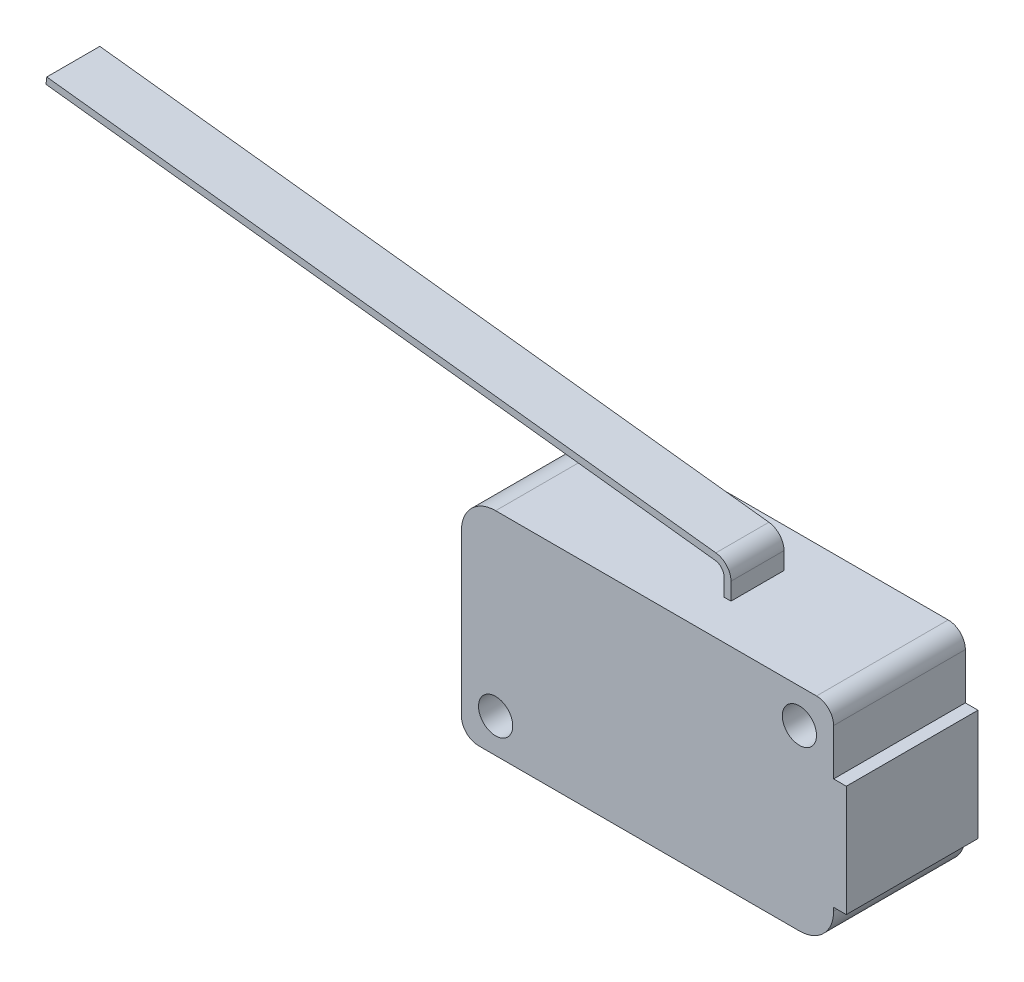
ISO-10303-21;
HEADER;
FILE_DESCRIPTION(('STEP AP214'),'2;1');
FILE_NAME('part.step','',(''),(''),'','','');
FILE_SCHEMA(('AUTOMOTIVE_DESIGN { 1 0 10303 214 1 1 1 1 }'));
ENDSEC;
DATA;
#1=APPLICATION_CONTEXT('core data for automotive mechanical design processes');
#2=APPLICATION_PROTOCOL_DEFINITION('international standard','automotive_design',2000,#1);
#3=PRODUCT_CONTEXT('',#1,'mechanical');
#4=PRODUCT('Part','Part','',(#3));
#5=PRODUCT_RELATED_PRODUCT_CATEGORY('part','',(#4));
#6=PRODUCT_DEFINITION_FORMATION('','',#4);
#7=PRODUCT_DEFINITION_CONTEXT('part definition',#1,'design');
#8=PRODUCT_DEFINITION('design','',#6,#7);
#9=PRODUCT_DEFINITION_SHAPE('','',#8);
#10=(LENGTH_UNIT() NAMED_UNIT(*) SI_UNIT(.MILLI.,.METRE.));
#11=(NAMED_UNIT(*) PLANE_ANGLE_UNIT() SI_UNIT($,.RADIAN.));
#12=(NAMED_UNIT(*) SI_UNIT($,.STERADIAN.) SOLID_ANGLE_UNIT());
#13=UNCERTAINTY_MEASURE_WITH_UNIT(LENGTH_MEASURE(1.E-05),#10,'distance_accuracy_value','');
#14=(GEOMETRIC_REPRESENTATION_CONTEXT(3) GLOBAL_UNCERTAINTY_ASSIGNED_CONTEXT((#13)) GLOBAL_UNIT_ASSIGNED_CONTEXT((#10,
#11,#12)) REPRESENTATION_CONTEXT('',''));
#15=CARTESIAN_POINT('',(0.,0.,0.));
#16=DIRECTION('',(0.,0.,1.));
#17=DIRECTION('',(1.,0.,0.));
#18=AXIS2_PLACEMENT_3D('',#15,#16,#17);
#19=CARTESIAN_POINT('',(-0.507999999999998,1.28180399212212,-1.9685));
#20=DIRECTION('',(-1.,0.,0.));
#21=DIRECTION('',(0.,-1.,0.));
#22=AXIS2_PLACEMENT_3D('',#19,#20,#21);
#23=PLANE('',#22);
#24=DIRECTION('',(0.,0.,1.));
#25=VECTOR('',#24,1.);
#26=CARTESIAN_POINT('',(-0.508,0.,-1.9685));
#27=LINE('',#26,#25);
#28=CARTESIAN_POINT('',(-0.508,0.,-1.9685));
#29=VERTEX_POINT('',#28);
#30=CARTESIAN_POINT('',(-0.507999999999999,0.,1.9685));
#31=VERTEX_POINT('',#30);
#32=EDGE_CURVE('E39',#29,#31,#27,.T.);
#33=ORIENTED_EDGE('',*,*,#32,.T.);
#34=DIRECTION('',(0.,-1.,0.));
#35=VECTOR('',#34,1.);
#36=CARTESIAN_POINT('',(-0.507999999999998,1.28180399212212,1.9685));
#37=LINE('',#36,#35);
#38=CARTESIAN_POINT('',(-0.507999999999998,1.28180399212212,1.9685));
#39=VERTEX_POINT('',#38);
#40=EDGE_CURVE('E234',#39,#31,#37,.T.);
#41=ORIENTED_EDGE('',*,*,#40,.F.);
#42=DIRECTION('',(0.,0.,1.));
#43=VECTOR('',#42,1.);
#44=CARTESIAN_POINT('',(-0.507999999999998,1.28180399212212,-1.9685));
#45=LINE('',#44,#43);
#46=CARTESIAN_POINT('',(-0.507999999999998,1.28180399212212,-1.9685));
#47=VERTEX_POINT('',#46);
#48=EDGE_CURVE('E11',#47,#39,#45,.T.);
#49=ORIENTED_EDGE('',*,*,#48,.F.);
#50=DIRECTION('',(0.,-1.,0.));
#51=VECTOR('',#50,1.);
#52=CARTESIAN_POINT('',(-0.507999999999998,1.28180399212212,-1.9685));
#53=LINE('',#52,#51);
#54=EDGE_CURVE('E183',#47,#29,#53,.T.);
#55=ORIENTED_EDGE('',*,*,#54,.T.);
#56=EDGE_LOOP('',(#33,#41,#49,#55));
#57=FACE_BOUND('',#56,.T.);
#58=ADVANCED_FACE('F36',(#57),#23,.T.);
#59=CARTESIAN_POINT('',(-1.27,1.28180399212212,-1.9685));
#60=DIRECTION('',(0.,0.,1.));
#61=DIRECTION('',(1.,0.,0.));
#62=AXIS2_PLACEMENT_3D('',#59,#60,#61);
#63=CYLINDRICAL_SURFACE('',#62,0.762);
#64=ORIENTED_EDGE('',*,*,#48,.T.);
#65=CARTESIAN_POINT('',(-1.27,1.28180399212212,1.9685));
#66=DIRECTION('',(0.,0.,1.));
#67=DIRECTION('',(1.,0.,0.));
#68=AXIS2_PLACEMENT_3D('',#65,#66,#67);
#69=CIRCLE('',#68,0.762);
#70=CARTESIAN_POINT('',(-1.18219676616617,2.03872842172412,1.9685));
#71=VERTEX_POINT('',#70);
#72=EDGE_CURVE('E237',#71,#39,#69,.F.);
#73=ORIENTED_EDGE('',*,*,#72,.F.);
#74=DIRECTION('',(0.,0.,1.));
#75=VECTOR('',#74,1.);
#76=CARTESIAN_POINT('',(-1.18219676616617,2.03872842172412,-1.9685));
#77=LINE('',#76,#75);
#78=CARTESIAN_POINT('',(-1.18219676616617,2.03872842172412,-1.9685));
#79=VERTEX_POINT('',#78);
#80=EDGE_CURVE('E44',#79,#71,#77,.T.);
#81=ORIENTED_EDGE('',*,*,#80,.F.);
#82=CARTESIAN_POINT('',(-1.27,1.28180399212212,-1.9685));
#83=DIRECTION('',(0.,0.,1.));
#84=DIRECTION('',(1.,0.,0.));
#85=AXIS2_PLACEMENT_3D('',#82,#83,#84);
#86=CIRCLE('',#85,0.762);
#87=EDGE_CURVE('E323',#79,#47,#86,.F.);
#88=ORIENTED_EDGE('',*,*,#87,.T.);
#89=EDGE_LOOP('',(#64,#73,#81,#88));
#90=FACE_BOUND('',#89,.T.);
#91=ADVANCED_FACE('F356',(#90),#63,.F.);
#92=CARTESIAN_POINT('',(-1.18219676616617,2.03872842172412,-1.9685));
#93=DIRECTION('',(-0.115227340989282,-0.993339146459325,0.));
#94=DIRECTION('',(0.993339146459325,-0.115227340989282,0.));
#95=AXIS2_PLACEMENT_3D('',#92,#93,#94);
#96=PLANE('',#95);
#97=ORIENTED_EDGE('',*,*,#80,.T.);
#98=DIRECTION('',(0.993339146459325,-0.115227340989282,0.));
#99=VECTOR('',#98,1.);
#100=CARTESIAN_POINT('',(-1.18219676616617,2.03872842172412,1.9685));
#101=LINE('',#100,#99);
#102=CARTESIAN_POINT('',(-50.8585354892226,7.80118371359866,1.9685));
#103=VERTEX_POINT('',#102);
#104=EDGE_CURVE('E240',#103,#71,#101,.T.);
#105=ORIENTED_EDGE('',*,*,#104,.F.);
#106=DIRECTION('',(0.,0.,1.));
#107=VECTOR('',#106,1.);
#108=CARTESIAN_POINT('',(-50.8585354892226,7.80118371359866,-1.9685));
#109=LINE('',#108,#107);
#110=CARTESIAN_POINT('',(-50.8585354892226,7.80118371359866,-1.9685));
#111=VERTEX_POINT('',#110);
#112=EDGE_CURVE('E326',#111,#103,#109,.T.);
#113=ORIENTED_EDGE('',*,*,#112,.F.);
#114=DIRECTION('',(0.993339146459325,-0.115227340989282,0.));
#115=VECTOR('',#114,1.);
#116=CARTESIAN_POINT('',(-1.18219676616617,2.03872842172412,-1.9685));
#117=LINE('',#116,#115);
#118=EDGE_CURVE('E321',#111,#79,#117,.T.);
#119=ORIENTED_EDGE('',*,*,#118,.T.);
#120=EDGE_LOOP('',(#97,#105,#113,#119));
#121=FACE_BOUND('',#120,.T.);
#122=ADVANCED_FACE('F360',(#121),#96,.T.);
#123=CARTESIAN_POINT('',(-50.8585354892226,7.80118371359866,-1.9685));
#124=DIRECTION('',(0.993339146459324,-0.115227340989285,0.));
#125=DIRECTION('',(0.115227340989285,0.993339146459324,0.));
#126=AXIS2_PLACEMENT_3D('',#123,#124,#125);
#127=PLANE('',#126);
#128=ORIENTED_EDGE('',*,*,#112,.T.);
#129=DIRECTION('',(0.115227340989285,0.993339146459325,0.));
#130=VECTOR('',#129,1.);
#131=CARTESIAN_POINT('',(-50.8585354892226,7.80118371359866,1.9685));
#132=LINE('',#131,#130);
#133=CARTESIAN_POINT('',(-50.8,8.3058,1.9685));
#134=VERTEX_POINT('',#133);
#135=EDGE_CURVE('E243',#103,#134,#132,.T.);
#136=ORIENTED_EDGE('',*,*,#135,.T.);
#137=DIRECTION('',(0.,0.,1.));
#138=VECTOR('',#137,1.);
#139=CARTESIAN_POINT('',(-50.8,8.3058,-1.9685));
#140=LINE('',#139,#138);
#141=CARTESIAN_POINT('',(-50.8,8.3058,-1.9685));
#142=VERTEX_POINT('',#141);
#143=EDGE_CURVE('E328',#142,#134,#140,.T.);
#144=ORIENTED_EDGE('',*,*,#143,.F.);
#145=DIRECTION('',(0.115227340989285,0.993339146459325,0.));
#146=VECTOR('',#145,1.);
#147=CARTESIAN_POINT('',(-50.8585354892226,7.80118371359866,-1.9685));
#148=LINE('',#147,#146);
#149=EDGE_CURVE('E319',#111,#142,#148,.T.);
#150=ORIENTED_EDGE('',*,*,#149,.F.);
#151=EDGE_LOOP('',(#128,#136,#144,#150));
#152=FACE_BOUND('',#151,.T.);
#153=ADVANCED_FACE('F365',(#152),#127,.F.);
#154=CARTESIAN_POINT('',(-1.12366127694361,2.54334470812546,-1.9685));
#155=DIRECTION('',(-0.115227340989282,-0.993339146459325,0.));
#156=DIRECTION('',(0.993339146459325,-0.115227340989282,0.));
#157=AXIS2_PLACEMENT_3D('',#154,#155,#156);
#158=PLANE('',#157);
#159=ORIENTED_EDGE('',*,*,#143,.T.);
#160=DIRECTION('',(0.993339146459325,-0.115227340989282,0.));
#161=VECTOR('',#160,1.);
#162=CARTESIAN_POINT('',(-1.12366127694361,2.54334470812546,1.9685));
#163=LINE('',#162,#161);
#164=CARTESIAN_POINT('',(-1.12366127694361,2.54334470812546,1.9685));
#165=VERTEX_POINT('',#164);
#166=EDGE_CURVE('E246',#134,#165,#163,.T.);
#167=ORIENTED_EDGE('',*,*,#166,.T.);
#168=DIRECTION('',(0.,0.,1.));
#169=VECTOR('',#168,1.);
#170=CARTESIAN_POINT('',(-1.12366127694361,2.54334470812546,-1.9685));
#171=LINE('',#170,#169);
#172=CARTESIAN_POINT('',(-1.12366127694361,2.54334470812546,-1.9685));
#173=VERTEX_POINT('',#172);
#174=EDGE_CURVE('E330',#173,#165,#171,.T.);
#175=ORIENTED_EDGE('',*,*,#174,.F.);
#176=DIRECTION('',(0.993339146459325,-0.115227340989282,0.));
#177=VECTOR('',#176,1.);
#178=CARTESIAN_POINT('',(-1.12366127694361,2.54334470812546,-1.9685));
#179=LINE('',#178,#177);
#180=EDGE_CURVE('E317',#142,#173,#179,.T.);
#181=ORIENTED_EDGE('',*,*,#180,.F.);
#182=EDGE_LOOP('',(#159,#167,#175,#181));
#183=FACE_BOUND('',#182,.T.);
#184=ADVANCED_FACE('F373',(#183),#158,.F.);
#185=CARTESIAN_POINT('',(-1.27,1.28180399212212,-1.9685));
#186=DIRECTION('',(0.,0.,1.));
#187=DIRECTION('',(1.,0.,0.));
#188=AXIS2_PLACEMENT_3D('',#185,#186,#187);
#189=CYLINDRICAL_SURFACE('',#188,1.27);
#190=ORIENTED_EDGE('',*,*,#174,.T.);
#191=CARTESIAN_POINT('',(-1.27,1.28180399212212,1.9685));
#192=DIRECTION('',(0.,0.,-1.));
#193=DIRECTION('',(-1.,0.,0.));
#194=AXIS2_PLACEMENT_3D('',#191,#192,#193);
#195=CIRCLE('',#194,1.27);
#196=CARTESIAN_POINT('',(0.,1.28180399212212,1.9685));
#197=VERTEX_POINT('',#196);
#198=EDGE_CURVE('E249',#165,#197,#195,.T.);
#199=ORIENTED_EDGE('',*,*,#198,.T.);
#200=DIRECTION('',(0.,0.,1.));
#201=VECTOR('',#200,1.);
#202=CARTESIAN_POINT('',(0.,1.28180399212212,-1.9685));
#203=LINE('',#202,#201);
#204=CARTESIAN_POINT('',(0.,1.28180399212212,-1.9685));
#205=VERTEX_POINT('',#204);
#206=EDGE_CURVE('E332',#205,#197,#203,.T.);
#207=ORIENTED_EDGE('',*,*,#206,.F.);
#208=CARTESIAN_POINT('',(-1.27,1.28180399212212,-1.9685));
#209=DIRECTION('',(0.,0.,-1.));
#210=DIRECTION('',(-1.,0.,0.));
#211=AXIS2_PLACEMENT_3D('',#208,#209,#210);
#212=CIRCLE('',#211,1.27);
#213=EDGE_CURVE('E315',#173,#205,#212,.T.);
#214=ORIENTED_EDGE('',*,*,#213,.F.);
#215=EDGE_LOOP('',(#190,#199,#207,#214));
#216=FACE_BOUND('',#215,.T.);
#217=ADVANCED_FACE('F377',(#216),#189,.T.);
#218=CARTESIAN_POINT('',(0.,1.28180399212212,-1.9685));
#219=DIRECTION('',(-1.,0.,0.));
#220=DIRECTION('',(0.,-1.,0.));
#221=AXIS2_PLACEMENT_3D('',#218,#219,#220);
#222=PLANE('',#221);
#223=ORIENTED_EDGE('',*,*,#206,.T.);
#224=DIRECTION('',(0.,-1.,0.));
#225=VECTOR('',#224,1.);
#226=CARTESIAN_POINT('',(0.,1.28180399212212,1.9685));
#227=LINE('',#226,#225);
#228=CARTESIAN_POINT('',(0.,0.,1.9685));
#229=VERTEX_POINT('',#228);
#230=EDGE_CURVE('E252',#197,#229,#227,.T.);
#231=ORIENTED_EDGE('',*,*,#230,.T.);
#232=DIRECTION('',(0.,0.,1.));
#233=VECTOR('',#232,1.);
#234=CARTESIAN_POINT('',(0.,0.,-1.9685));
#235=LINE('',#234,#233);
#236=CARTESIAN_POINT('',(0.,0.,-1.9685));
#237=VERTEX_POINT('',#236);
#238=EDGE_CURVE('E333',#237,#229,#235,.T.);
#239=ORIENTED_EDGE('',*,*,#238,.F.);
#240=DIRECTION('',(0.,-1.,0.));
#241=VECTOR('',#240,1.);
#242=CARTESIAN_POINT('',(0.,1.28180399212212,-1.9685));
#243=LINE('',#242,#241);
#244=EDGE_CURVE('E313',#205,#237,#243,.T.);
#245=ORIENTED_EDGE('',*,*,#244,.F.);
#246=EDGE_LOOP('',(#223,#231,#239,#245));
#247=FACE_BOUND('',#246,.T.);
#248=ADVANCED_FACE('F380',(#247),#222,.F.);
#249=CARTESIAN_POINT('',(-1.27,1.28180399212212,-1.9685));
#250=DIRECTION('',(0.,0.,-1.));
#251=DIRECTION('',(-1.,0.,0.));
#252=AXIS2_PLACEMENT_3D('',#249,#250,#251);
#253=PLANE('',#252);
#254=ORIENTED_EDGE('',*,*,#54,.F.);
#255=ORIENTED_EDGE('',*,*,#87,.F.);
#256=ORIENTED_EDGE('',*,*,#118,.F.);
#257=ORIENTED_EDGE('',*,*,#149,.T.);
#258=ORIENTED_EDGE('',*,*,#180,.T.);
#259=ORIENTED_EDGE('',*,*,#213,.T.);
#260=ORIENTED_EDGE('',*,*,#244,.T.);
#261=DIRECTION('',(-1.,0.,0.));
#262=VECTOR('',#261,1.);
#263=CARTESIAN_POINT('',(0.,0.,-1.9685));
#264=LINE('',#263,#262);
#265=EDGE_CURVE('E311',#237,#29,#264,.T.);
#266=ORIENTED_EDGE('',*,*,#265,.T.);
#267=EDGE_LOOP('',(#254,#255,#256,#257,#258,#259,#260,#266));
#268=FACE_BOUND('',#267,.T.);
#269=ADVANCED_FACE('F352',(#268),#253,.T.);
#270=CARTESIAN_POINT('',(-14.5542,-2.54,-4.8895));
#271=DIRECTION('',(0.,0.,1.));
#272=DIRECTION('',(1.,0.,0.));
#273=AXIS2_PLACEMENT_3D('',#270,#271,#272);
#274=CYLINDRICAL_SURFACE('',#273,2.54);
#275=DIRECTION('',(0.,0.,1.));
#276=VECTOR('',#275,1.);
#277=CARTESIAN_POINT('',(-17.0942,-2.54,-4.8895));
#278=LINE('',#277,#276);
#279=CARTESIAN_POINT('',(-17.0942,-2.54,-4.8895));
#280=VERTEX_POINT('',#279);
#281=CARTESIAN_POINT('',(-17.0942,-2.54,4.8895));
#282=VERTEX_POINT('',#281);
#283=EDGE_CURVE('E199',#280,#282,#278,.T.);
#284=ORIENTED_EDGE('',*,*,#283,.T.);
#285=CARTESIAN_POINT('',(-14.5542,-2.54,4.8895));
#286=DIRECTION('',(0.,0.,1.));
#287=DIRECTION('',(1.,0.,0.));
#288=AXIS2_PLACEMENT_3D('',#285,#286,#287);
#289=CIRCLE('',#288,2.54);
#290=CARTESIAN_POINT('',(-14.5542,0.,4.8895));
#291=VERTEX_POINT('',#290);
#292=EDGE_CURVE('E191',#282,#291,#289,.F.);
#293=ORIENTED_EDGE('',*,*,#292,.T.);
#294=DIRECTION('',(0.,0.,1.));
#295=VECTOR('',#294,1.);
#296=CARTESIAN_POINT('',(-14.5542,0.,-4.8895));
#297=LINE('',#296,#295);
#298=CARTESIAN_POINT('',(-14.5542,0.,-4.8895));
#299=VERTEX_POINT('',#298);
#300=EDGE_CURVE('E173',#299,#291,#297,.T.);
#301=ORIENTED_EDGE('',*,*,#300,.F.);
#302=CARTESIAN_POINT('',(-14.5542,-2.54,-4.8895));
#303=DIRECTION('',(0.,0.,1.));
#304=DIRECTION('',(1.,0.,0.));
#305=AXIS2_PLACEMENT_3D('',#302,#303,#304);
#306=CIRCLE('',#305,2.54);
#307=EDGE_CURVE('E264',#280,#299,#306,.F.);
#308=ORIENTED_EDGE('',*,*,#307,.F.);
#309=EDGE_LOOP('',(#284,#293,#301,#308));
#310=FACE_BOUND('',#309,.T.);
#311=ADVANCED_FACE('F197',(#310),#274,.T.);
#312=CARTESIAN_POINT('',(0.,0.,-4.8895));
#313=DIRECTION('',(0.,-1.,0.));
#314=DIRECTION('',(0.,0.,-1.));
#315=AXIS2_PLACEMENT_3D('',#312,#313,#314);
#316=PLANE('',#315);
#317=DIRECTION('',(-1.,0.,0.));
#318=VECTOR('',#317,1.);
#319=CARTESIAN_POINT('',(0.,0.,1.9685));
#320=LINE('',#319,#318);
#321=EDGE_CURVE('E255',#229,#31,#320,.T.);
#322=ORIENTED_EDGE('',*,*,#321,.T.);
#323=ORIENTED_EDGE('',*,*,#32,.F.);
#324=ORIENTED_EDGE('',*,*,#265,.F.);
#325=ORIENTED_EDGE('',*,*,#238,.T.);
#326=EDGE_LOOP('',(#322,#323,#324,#325));
#327=FACE_BOUND('',#326,.T.);
#328=ORIENTED_EDGE('',*,*,#300,.T.);
#329=DIRECTION('',(1.,0.,0.));
#330=VECTOR('',#329,1.);
#331=CARTESIAN_POINT('',(0.,0.,4.8895));
#332=LINE('',#331,#330);
#333=CARTESIAN_POINT('',(9.271,0.,4.8895));
#334=VERTEX_POINT('',#333);
#335=EDGE_CURVE('E177',#291,#334,#332,.T.);
#336=ORIENTED_EDGE('',*,*,#335,.T.);
#337=DIRECTION('',(0.,0.,1.));
#338=VECTOR('',#337,1.);
#339=CARTESIAN_POINT('',(9.271,0.,-4.8895));
#340=LINE('',#339,#338);
#341=CARTESIAN_POINT('',(9.271,0.,-4.8895));
#342=VERTEX_POINT('',#341);
#343=EDGE_CURVE('E184',#342,#334,#340,.T.);
#344=ORIENTED_EDGE('',*,*,#343,.F.);
#345=DIRECTION('',(1.,0.,0.));
#346=VECTOR('',#345,1.);
#347=CARTESIAN_POINT('',(0.,0.,-4.8895));
#348=LINE('',#347,#346);
#349=EDGE_CURVE('E178',#299,#342,#348,.T.);
#350=ORIENTED_EDGE('',*,*,#349,.F.);
#351=EDGE_LOOP('',(#328,#336,#344,#350));
#352=FACE_BOUND('',#351,.T.);
#353=ADVANCED_FACE('F175',(#327,#352),#316,.F.);
#354=CARTESIAN_POINT('',(9.271,-1.27,-4.8895));
#355=DIRECTION('',(0.,0.,1.));
#356=DIRECTION('',(1.,0.,0.));
#357=AXIS2_PLACEMENT_3D('',#354,#355,#356);
#358=CYLINDRICAL_SURFACE('',#357,1.27);
#359=ORIENTED_EDGE('',*,*,#343,.T.);
#360=CARTESIAN_POINT('',(9.271,-1.27,4.8895));
#361=DIRECTION('',(0.,0.,1.));
#362=DIRECTION('',(1.,0.,0.));
#363=AXIS2_PLACEMENT_3D('',#360,#361,#362);
#364=CIRCLE('',#363,1.27);
#365=CARTESIAN_POINT('',(10.541,-1.27,4.8895));
#366=VERTEX_POINT('',#365);
#367=EDGE_CURVE('E195',#366,#334,#364,.T.);
#368=ORIENTED_EDGE('',*,*,#367,.F.);
#369=DIRECTION('',(0.,0.,1.));
#370=VECTOR('',#369,1.);
#371=CARTESIAN_POINT('',(10.541,-1.27,-4.8895));
#372=LINE('',#371,#370);
#373=CARTESIAN_POINT('',(10.541,-1.27,-4.8895));
#374=VERTEX_POINT('',#373);
#375=EDGE_CURVE('E291',#374,#366,#372,.T.);
#376=ORIENTED_EDGE('',*,*,#375,.F.);
#377=CARTESIAN_POINT('',(9.271,-1.27,-4.8895));
#378=DIRECTION('',(0.,0.,1.));
#379=DIRECTION('',(1.,0.,0.));
#380=AXIS2_PLACEMENT_3D('',#377,#378,#379);
#381=CIRCLE('',#380,1.27);
#382=EDGE_CURVE('E286',#374,#342,#381,.T.);
#383=ORIENTED_EDGE('',*,*,#382,.T.);
#384=EDGE_LOOP('',(#359,#368,#376,#383));
#385=FACE_BOUND('',#384,.T.);
#386=ADVANCED_FACE('F343',(#385),#358,.T.);
#387=CARTESIAN_POINT('',(10.541,0.,-4.8895));
#388=DIRECTION('',(-1.,0.,0.));
#389=DIRECTION('',(0.,-1.,0.));
#390=AXIS2_PLACEMENT_3D('',#387,#388,#389);
#391=PLANE('',#390);
#392=ORIENTED_EDGE('',*,*,#375,.T.);
#393=DIRECTION('',(0.,-1.,0.));
#394=VECTOR('',#393,1.);
#395=CARTESIAN_POINT('',(10.541,0.,4.8895));
#396=LINE('',#395,#394);
#397=CARTESIAN_POINT('',(10.541,-4.699,4.8895));
#398=VERTEX_POINT('',#397);
#399=EDGE_CURVE('E208',#366,#398,#396,.T.);
#400=ORIENTED_EDGE('',*,*,#399,.T.);
#401=DIRECTION('',(0.,0.,1.));
#402=VECTOR('',#401,1.);
#403=CARTESIAN_POINT('',(10.541,-4.699,-4.8895));
#404=LINE('',#403,#402);
#405=CARTESIAN_POINT('',(10.541,-4.699,-4.8895));
#406=VERTEX_POINT('',#405);
#407=EDGE_CURVE('E293',#406,#398,#404,.T.);
#408=ORIENTED_EDGE('',*,*,#407,.F.);
#409=DIRECTION('',(0.,-1.,0.));
#410=VECTOR('',#409,1.);
#411=CARTESIAN_POINT('',(10.541,0.,-4.8895));
#412=LINE('',#411,#410);
#413=EDGE_CURVE('E284',#374,#406,#412,.T.);
#414=ORIENTED_EDGE('',*,*,#413,.F.);
#415=EDGE_LOOP('',(#392,#400,#408,#414));
#416=FACE_BOUND('',#415,.T.);
#417=ADVANCED_FACE('F349',(#416),#391,.F.);
#418=CARTESIAN_POINT('',(0.,-4.699,-4.8895));
#419=DIRECTION('',(0.,1.,0.));
#420=DIRECTION('',(0.,0.,1.));
#421=AXIS2_PLACEMENT_3D('',#418,#419,#420);
#422=PLANE('',#421);
#423=ORIENTED_EDGE('',*,*,#407,.T.);
#424=DIRECTION('',(-1.,0.,0.));
#425=VECTOR('',#424,1.);
#426=CARTESIAN_POINT('',(0.,-4.699,4.8895));
#427=LINE('',#426,#425);
#428=CARTESIAN_POINT('',(11.4808,-4.699,4.8895));
#429=VERTEX_POINT('',#428);
#430=EDGE_CURVE('E211',#429,#398,#427,.T.);
#431=ORIENTED_EDGE('',*,*,#430,.F.);
#432=DIRECTION('',(0.,0.,1.));
#433=VECTOR('',#432,1.);
#434=CARTESIAN_POINT('',(11.4808,-4.699,-4.8895));
#435=LINE('',#434,#433);
#436=CARTESIAN_POINT('',(11.4808,-4.699,-4.8895));
#437=VERTEX_POINT('',#436);
#438=EDGE_CURVE('E295',#437,#429,#435,.T.);
#439=ORIENTED_EDGE('',*,*,#438,.F.);
#440=DIRECTION('',(-1.,0.,0.));
#441=VECTOR('',#440,1.);
#442=CARTESIAN_POINT('',(0.,-4.699,-4.8895));
#443=LINE('',#442,#441);
#444=EDGE_CURVE('E281',#437,#406,#443,.T.);
#445=ORIENTED_EDGE('',*,*,#444,.T.);
#446=EDGE_LOOP('',(#423,#431,#439,#445));
#447=FACE_BOUND('',#446,.T.);
#448=ADVANCED_FACE('F434',(#447),#422,.T.);
#449=CARTESIAN_POINT('',(11.4808,0.,-4.8895));
#450=DIRECTION('',(-1.,0.,0.));
#451=DIRECTION('',(0.,0.,1.));
#452=AXIS2_PLACEMENT_3D('',#449,#450,#451);
#453=PLANE('',#452);
#454=ORIENTED_EDGE('',*,*,#438,.T.);
#455=DIRECTION('',(0.,-1.,0.));
#456=VECTOR('',#455,1.);
#457=CARTESIAN_POINT('',(11.4808,0.,4.8895));
#458=LINE('',#457,#456);
#459=CARTESIAN_POINT('',(11.4808,-12.954,4.8895));
#460=VERTEX_POINT('',#459);
#461=EDGE_CURVE('E214',#429,#460,#458,.T.);
#462=ORIENTED_EDGE('',*,*,#461,.T.);
#463=DIRECTION('',(0.,0.,1.));
#464=VECTOR('',#463,1.);
#465=CARTESIAN_POINT('',(11.4808,-12.954,-4.8895));
#466=LINE('',#465,#464);
#467=CARTESIAN_POINT('',(11.4808,-12.954,-4.8895));
#468=VERTEX_POINT('',#467);
#469=EDGE_CURVE('E297',#468,#460,#466,.T.);
#470=ORIENTED_EDGE('',*,*,#469,.F.);
#471=DIRECTION('',(0.,-1.,0.));
#472=VECTOR('',#471,1.);
#473=CARTESIAN_POINT('',(11.4808,0.,-4.8895));
#474=LINE('',#473,#472);
#475=EDGE_CURVE('E279',#437,#468,#474,.T.);
#476=ORIENTED_EDGE('',*,*,#475,.F.);
#477=EDGE_LOOP('',(#454,#462,#470,#476));
#478=FACE_BOUND('',#477,.T.);
#479=ADVANCED_FACE('F445',(#478),#453,.F.);
#480=CARTESIAN_POINT('',(0.,-12.954,-4.8895));
#481=DIRECTION('',(0.,1.,0.));
#482=DIRECTION('',(0.,0.,1.));
#483=AXIS2_PLACEMENT_3D('',#480,#481,#482);
#484=PLANE('',#483);
#485=ORIENTED_EDGE('',*,*,#469,.T.);
#486=DIRECTION('',(-1.,0.,0.));
#487=VECTOR('',#486,1.);
#488=CARTESIAN_POINT('',(0.,-12.954,4.8895));
#489=LINE('',#488,#487);
#490=CARTESIAN_POINT('',(10.541,-12.954,4.8895));
#491=VERTEX_POINT('',#490);
#492=EDGE_CURVE('E217',#460,#491,#489,.T.);
#493=ORIENTED_EDGE('',*,*,#492,.T.);
#494=DIRECTION('',(0.,0.,1.));
#495=VECTOR('',#494,1.);
#496=CARTESIAN_POINT('',(10.541,-12.954,-4.8895));
#497=LINE('',#496,#495);
#498=CARTESIAN_POINT('',(10.541,-12.954,-4.8895));
#499=VERTEX_POINT('',#498);
#500=EDGE_CURVE('E299',#499,#491,#497,.T.);
#501=ORIENTED_EDGE('',*,*,#500,.F.);
#502=DIRECTION('',(-1.,0.,0.));
#503=VECTOR('',#502,1.);
#504=CARTESIAN_POINT('',(0.,-12.954,-4.8895));
#505=LINE('',#504,#503);
#506=EDGE_CURVE('E277',#468,#499,#505,.T.);
#507=ORIENTED_EDGE('',*,*,#506,.F.);
#508=EDGE_LOOP('',(#485,#493,#501,#507));
#509=FACE_BOUND('',#508,.T.);
#510=ADVANCED_FACE('F456',(#509),#484,.F.);
#511=CARTESIAN_POINT('',(10.541,0.,-4.8895));
#512=DIRECTION('',(-1.,0.,0.));
#513=DIRECTION('',(0.,0.,1.));
#514=AXIS2_PLACEMENT_3D('',#511,#512,#513);
#515=PLANE('',#514);
#516=ORIENTED_EDGE('',*,*,#500,.T.);
#517=DIRECTION('',(0.,-1.,0.));
#518=VECTOR('',#517,1.);
#519=CARTESIAN_POINT('',(10.541,0.,4.8895));
#520=LINE('',#519,#518);
#521=CARTESIAN_POINT('',(10.541,-13.208,4.8895));
#522=VERTEX_POINT('',#521);
#523=EDGE_CURVE('E220',#491,#522,#520,.T.);
#524=ORIENTED_EDGE('',*,*,#523,.T.);
#525=DIRECTION('',(0.,0.,1.));
#526=VECTOR('',#525,1.);
#527=CARTESIAN_POINT('',(10.541,-13.208,-4.8895));
#528=LINE('',#527,#526);
#529=CARTESIAN_POINT('',(10.541,-13.208,-4.8895));
#530=VERTEX_POINT('',#529);
#531=EDGE_CURVE('E301',#530,#522,#528,.T.);
#532=ORIENTED_EDGE('',*,*,#531,.F.);
#533=DIRECTION('',(0.,-1.,0.));
#534=VECTOR('',#533,1.);
#535=CARTESIAN_POINT('',(10.541,0.,-4.8895));
#536=LINE('',#535,#534);
#537=EDGE_CURVE('E275',#499,#530,#536,.T.);
#538=ORIENTED_EDGE('',*,*,#537,.F.);
#539=EDGE_LOOP('',(#516,#524,#532,#538));
#540=FACE_BOUND('',#539,.T.);
#541=ADVANCED_FACE('F467',(#540),#515,.F.);
#542=CARTESIAN_POINT('',(8.001,-13.208,-4.8895));
#543=DIRECTION('',(0.,0.,1.));
#544=DIRECTION('',(1.,0.,0.));
#545=AXIS2_PLACEMENT_3D('',#542,#543,#544);
#546=CYLINDRICAL_SURFACE('',#545,2.54);
#547=ORIENTED_EDGE('',*,*,#531,.T.);
#548=CARTESIAN_POINT('',(8.001,-13.208,4.8895));
#549=DIRECTION('',(0.,0.,1.));
#550=DIRECTION('',(1.,0.,0.));
#551=AXIS2_PLACEMENT_3D('',#548,#549,#550);
#552=CIRCLE('',#551,2.54);
#553=CARTESIAN_POINT('',(8.001,-15.748,4.8895));
#554=VERTEX_POINT('',#553);
#555=EDGE_CURVE('E223',#522,#554,#552,.F.);
#556=ORIENTED_EDGE('',*,*,#555,.T.);
#557=DIRECTION('',(0.,0.,1.));
#558=VECTOR('',#557,1.);
#559=CARTESIAN_POINT('',(8.001,-15.748,-4.8895));
#560=LINE('',#559,#558);
#561=CARTESIAN_POINT('',(8.001,-15.748,-4.8895));
#562=VERTEX_POINT('',#561);
#563=EDGE_CURVE('E303',#562,#554,#560,.T.);
#564=ORIENTED_EDGE('',*,*,#563,.F.);
#565=CARTESIAN_POINT('',(8.001,-13.208,-4.8895));
#566=DIRECTION('',(0.,0.,1.));
#567=DIRECTION('',(1.,0.,0.));
#568=AXIS2_PLACEMENT_3D('',#565,#566,#567);
#569=CIRCLE('',#568,2.54);
#570=EDGE_CURVE('E273',#530,#562,#569,.F.);
#571=ORIENTED_EDGE('',*,*,#570,.F.);
#572=EDGE_LOOP('',(#547,#556,#564,#571));
#573=FACE_BOUND('',#572,.T.);
#574=ADVANCED_FACE('F478',(#573),#546,.T.);
#575=CARTESIAN_POINT('',(0.,-15.748,-4.8895));
#576=DIRECTION('',(0.,1.,0.));
#577=DIRECTION('',(0.,0.,1.));
#578=AXIS2_PLACEMENT_3D('',#575,#576,#577);
#579=PLANE('',#578);
#580=ORIENTED_EDGE('',*,*,#563,.T.);
#581=DIRECTION('',(-1.,0.,0.));
#582=VECTOR('',#581,1.);
#583=CARTESIAN_POINT('',(0.,-15.748,4.8895));
#584=LINE('',#583,#582);
#585=CARTESIAN_POINT('',(-15.8242,-15.748,4.8895));
#586=VERTEX_POINT('',#585);
#587=EDGE_CURVE('E226',#554,#586,#584,.T.);
#588=ORIENTED_EDGE('',*,*,#587,.T.);
#589=DIRECTION('',(0.,0.,1.));
#590=VECTOR('',#589,1.);
#591=CARTESIAN_POINT('',(-15.8242,-15.748,-4.8895));
#592=LINE('',#591,#590);
#593=CARTESIAN_POINT('',(-15.8242,-15.748,-4.8895));
#594=VERTEX_POINT('',#593);
#595=EDGE_CURVE('E305',#594,#586,#592,.T.);
#596=ORIENTED_EDGE('',*,*,#595,.F.);
#597=DIRECTION('',(-1.,0.,0.));
#598=VECTOR('',#597,1.);
#599=CARTESIAN_POINT('',(0.,-15.748,-4.8895));
#600=LINE('',#599,#598);
#601=EDGE_CURVE('E271',#562,#594,#600,.T.);
#602=ORIENTED_EDGE('',*,*,#601,.F.);
#603=EDGE_LOOP('',(#580,#588,#596,#602));
#604=FACE_BOUND('',#603,.T.);
#605=ADVANCED_FACE('F489',(#604),#579,.F.);
#606=CARTESIAN_POINT('',(-15.8242,-14.478,-4.8895));
#607=DIRECTION('',(0.,0.,1.));
#608=DIRECTION('',(1.,0.,0.));
#609=AXIS2_PLACEMENT_3D('',#606,#607,#608);
#610=CYLINDRICAL_SURFACE('',#609,1.27);
#611=ORIENTED_EDGE('',*,*,#595,.T.);
#612=CARTESIAN_POINT('',(-15.8242,-14.478,4.8895));
#613=DIRECTION('',(0.,0.,1.));
#614=DIRECTION('',(1.,0.,0.));
#615=AXIS2_PLACEMENT_3D('',#612,#613,#614);
#616=CIRCLE('',#615,1.27);
#617=CARTESIAN_POINT('',(-17.0942,-14.478,4.8895));
#618=VERTEX_POINT('',#617);
#619=EDGE_CURVE('E229',#618,#586,#616,.T.);
#620=ORIENTED_EDGE('',*,*,#619,.F.);
#621=DIRECTION('',(0.,0.,1.));
#622=VECTOR('',#621,1.);
#623=CARTESIAN_POINT('',(-17.0942,-14.478,-4.8895));
#624=LINE('',#623,#622);
#625=CARTESIAN_POINT('',(-17.0942,-14.478,-4.8895));
#626=VERTEX_POINT('',#625);
#627=EDGE_CURVE('E307',#626,#618,#624,.T.);
#628=ORIENTED_EDGE('',*,*,#627,.F.);
#629=CARTESIAN_POINT('',(-15.8242,-14.478,-4.8895));
#630=DIRECTION('',(0.,0.,1.));
#631=DIRECTION('',(1.,0.,0.));
#632=AXIS2_PLACEMENT_3D('',#629,#630,#631);
#633=CIRCLE('',#632,1.27);
#634=EDGE_CURVE('E268',#626,#594,#633,.T.);
#635=ORIENTED_EDGE('',*,*,#634,.T.);
#636=EDGE_LOOP('',(#611,#620,#628,#635));
#637=FACE_BOUND('',#636,.T.);
#638=ADVANCED_FACE('F500',(#637),#610,.T.);
#639=CARTESIAN_POINT('',(8.001,-2.54,-4.8895));
#640=DIRECTION('',(0.,0.,1.));
#641=DIRECTION('',(1.,0.,0.));
#642=AXIS2_PLACEMENT_3D('',#639,#640,#641);
#643=CYLINDRICAL_SURFACE('',#642,1.27);
#644=CARTESIAN_POINT('',(8.001,-2.54,-4.8895));
#645=DIRECTION('',(0.,0.,1.));
#646=DIRECTION('',(1.,0.,0.));
#647=AXIS2_PLACEMENT_3D('',#644,#645,#646);
#648=CIRCLE('',#647,1.27);
#649=CARTESIAN_POINT('',(9.271,-2.54,-4.8895));
#650=VERTEX_POINT('',#649);
#651=EDGE_CURVE('E261',#650,#650,#648,.T.);
#652=ORIENTED_EDGE('',*,*,#651,.F.);
#653=EDGE_LOOP('',(#652));
#654=FACE_BOUND('',#653,.T.);
#655=CARTESIAN_POINT('',(8.001,-2.54,4.8895));
#656=DIRECTION('',(0.,0.,1.));
#657=DIRECTION('',(1.,0.,0.));
#658=AXIS2_PLACEMENT_3D('',#655,#656,#657);
#659=CIRCLE('',#658,1.27);
#660=CARTESIAN_POINT('',(9.271,-2.54,4.8895));
#661=VERTEX_POINT('',#660);
#662=EDGE_CURVE('E200',#661,#661,#659,.T.);
#663=ORIENTED_EDGE('',*,*,#662,.T.);
#664=EDGE_LOOP('',(#663));
#665=FACE_BOUND('',#664,.T.);
#666=ADVANCED_FACE('F511',(#654,#665),#643,.F.);
#667=CARTESIAN_POINT('',(-14.5542,-13.208,-4.8895));
#668=DIRECTION('',(0.,0.,1.));
#669=DIRECTION('',(1.,0.,0.));
#670=AXIS2_PLACEMENT_3D('',#667,#668,#669);
#671=CYLINDRICAL_SURFACE('',#670,1.27);
#672=CARTESIAN_POINT('',(-14.5542,-13.208,-4.8895));
#673=DIRECTION('',(0.,0.,1.));
#674=DIRECTION('',(1.,0.,0.));
#675=AXIS2_PLACEMENT_3D('',#672,#673,#674);
#676=CIRCLE('',#675,1.27);
#677=CARTESIAN_POINT('',(-13.2842,-13.208,-4.8895));
#678=VERTEX_POINT('',#677);
#679=EDGE_CURVE('E258',#678,#678,#676,.T.);
#680=ORIENTED_EDGE('',*,*,#679,.F.);
#681=EDGE_LOOP('',(#680));
#682=FACE_BOUND('',#681,.T.);
#683=CARTESIAN_POINT('',(-14.5542,-13.208,4.8895));
#684=DIRECTION('',(0.,0.,1.));
#685=DIRECTION('',(1.,0.,0.));
#686=AXIS2_PLACEMENT_3D('',#683,#684,#685);
#687=CIRCLE('',#686,1.27);
#688=CARTESIAN_POINT('',(-13.2842,-13.208,4.8895));
#689=VERTEX_POINT('',#688);
#690=EDGE_CURVE('E203',#689,#689,#687,.T.);
#691=ORIENTED_EDGE('',*,*,#690,.T.);
#692=EDGE_LOOP('',(#691));
#693=FACE_BOUND('',#692,.T.);
#694=ADVANCED_FACE('F522',(#682,#693),#671,.F.);
#695=CARTESIAN_POINT('',(-17.0942,0.,-4.8895));
#696=DIRECTION('',(1.,0.,0.));
#697=DIRECTION('',(0.,1.,0.));
#698=AXIS2_PLACEMENT_3D('',#695,#696,#697);
#699=PLANE('',#698);
#700=ORIENTED_EDGE('',*,*,#627,.T.);
#701=DIRECTION('',(0.,1.,0.));
#702=VECTOR('',#701,1.);
#703=CARTESIAN_POINT('',(-17.0942,0.,4.8895));
#704=LINE('',#703,#702);
#705=EDGE_CURVE('E232',#618,#282,#704,.T.);
#706=ORIENTED_EDGE('',*,*,#705,.T.);
#707=ORIENTED_EDGE('',*,*,#283,.F.);
#708=DIRECTION('',(0.,1.,0.));
#709=VECTOR('',#708,1.);
#710=CARTESIAN_POINT('',(-17.0942,0.,-4.8895));
#711=LINE('',#710,#709);
#712=EDGE_CURVE('E266',#626,#280,#711,.T.);
#713=ORIENTED_EDGE('',*,*,#712,.F.);
#714=EDGE_LOOP('',(#700,#706,#707,#713));
#715=FACE_BOUND('',#714,.T.);
#716=ADVANCED_FACE('F533',(#715),#699,.F.);
#717=CARTESIAN_POINT('',(0.,0.,-4.8895));
#718=DIRECTION('',(0.,0.,1.));
#719=DIRECTION('',(1.,0.,0.));
#720=AXIS2_PLACEMENT_3D('',#717,#718,#719);
#721=PLANE('',#720);
#722=ORIENTED_EDGE('',*,*,#679,.T.);
#723=EDGE_LOOP('',(#722));
#724=FACE_BOUND('',#723,.T.);
#725=ORIENTED_EDGE('',*,*,#651,.T.);
#726=EDGE_LOOP('',(#725));
#727=FACE_BOUND('',#726,.T.);
#728=ORIENTED_EDGE('',*,*,#307,.T.);
#729=ORIENTED_EDGE('',*,*,#349,.T.);
#730=ORIENTED_EDGE('',*,*,#382,.F.);
#731=ORIENTED_EDGE('',*,*,#413,.T.);
#732=ORIENTED_EDGE('',*,*,#444,.F.);
#733=ORIENTED_EDGE('',*,*,#475,.T.);
#734=ORIENTED_EDGE('',*,*,#506,.T.);
#735=ORIENTED_EDGE('',*,*,#537,.T.);
#736=ORIENTED_EDGE('',*,*,#570,.T.);
#737=ORIENTED_EDGE('',*,*,#601,.T.);
#738=ORIENTED_EDGE('',*,*,#634,.F.);
#739=ORIENTED_EDGE('',*,*,#712,.T.);
#740=EDGE_LOOP('',(#728,#729,#730,#731,#732,#733,#734,#735,#736,#737,#738,#739));
#741=FACE_BOUND('',#740,.T.);
#742=ADVANCED_FACE('F543',(#724,#727,#741),#721,.F.);
#743=CARTESIAN_POINT('',(-1.27,1.28180399212212,1.9685));
#744=DIRECTION('',(0.,0.,1.));
#745=DIRECTION('',(-1.,0.,0.));
#746=AXIS2_PLACEMENT_3D('',#743,#744,#745);
#747=PLANE('',#746);
#748=ORIENTED_EDGE('',*,*,#40,.T.);
#749=ORIENTED_EDGE('',*,*,#321,.F.);
#750=ORIENTED_EDGE('',*,*,#230,.F.);
#751=ORIENTED_EDGE('',*,*,#198,.F.);
#752=ORIENTED_EDGE('',*,*,#166,.F.);
#753=ORIENTED_EDGE('',*,*,#135,.F.);
#754=ORIENTED_EDGE('',*,*,#104,.T.);
#755=ORIENTED_EDGE('',*,*,#72,.T.);
#756=EDGE_LOOP('',(#748,#749,#750,#751,#752,#753,#754,#755));
#757=FACE_BOUND('',#756,.T.);
#758=ADVANCED_FACE('F340',(#757),#747,.T.);
#759=CARTESIAN_POINT('',(0.,0.,4.8895));
#760=DIRECTION('',(0.,0.,-1.));
#761=DIRECTION('',(1.,0.,0.));
#762=AXIS2_PLACEMENT_3D('',#759,#760,#761);
#763=PLANE('',#762);
#764=ORIENTED_EDGE('',*,*,#690,.F.);
#765=EDGE_LOOP('',(#764));
#766=FACE_BOUND('',#765,.T.);
#767=ORIENTED_EDGE('',*,*,#662,.F.);
#768=EDGE_LOOP('',(#767));
#769=FACE_BOUND('',#768,.T.);
#770=ORIENTED_EDGE('',*,*,#292,.F.);
#771=ORIENTED_EDGE('',*,*,#705,.F.);
#772=ORIENTED_EDGE('',*,*,#619,.T.);
#773=ORIENTED_EDGE('',*,*,#587,.F.);
#774=ORIENTED_EDGE('',*,*,#555,.F.);
#775=ORIENTED_EDGE('',*,*,#523,.F.);
#776=ORIENTED_EDGE('',*,*,#492,.F.);
#777=ORIENTED_EDGE('',*,*,#461,.F.);
#778=ORIENTED_EDGE('',*,*,#430,.T.);
#779=ORIENTED_EDGE('',*,*,#399,.F.);
#780=ORIENTED_EDGE('',*,*,#367,.T.);
#781=ORIENTED_EDGE('',*,*,#335,.F.);
#782=EDGE_LOOP('',(#770,#771,#772,#773,#774,#775,#776,#777,#778,#779,#780,#781));
#783=FACE_BOUND('',#782,.T.);
#784=ADVANCED_FACE('F189',(#766,#769,#783),#763,.F.);
#785=CLOSED_SHELL('',(#58,#91,#122,#153,#184,#217,#248,#269,#311,#353,#386,#417,#448,#479,#510,
#541,#574,#605,#638,#666,#694,#716,#742,#758,#784));
#786=MANIFOLD_SOLID_BREP('B2',#785);
#787=ADVANCED_BREP_SHAPE_REPRESENTATION('',(#18,#786),#14);
#788=SHAPE_DEFINITION_REPRESENTATION(#9,#787);
ENDSEC;
END-ISO-10303-21;
